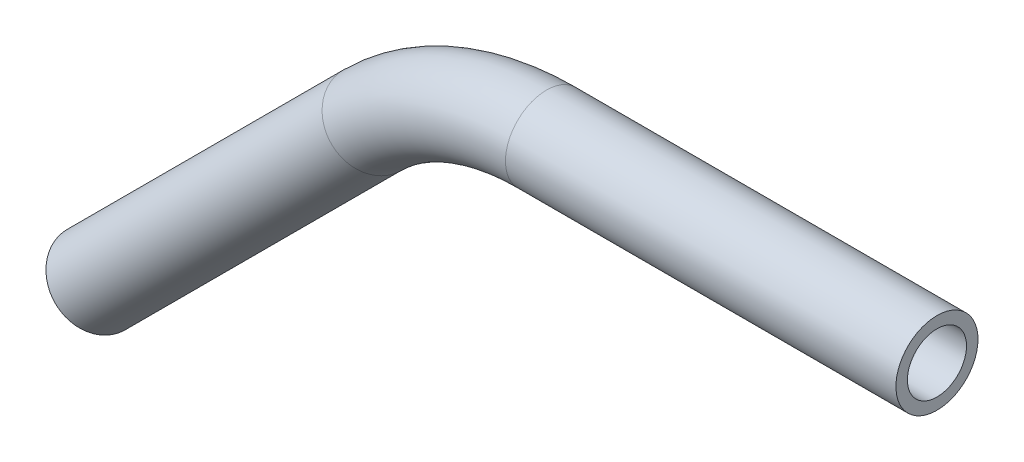
ISO-10303-21;
HEADER;
FILE_DESCRIPTION(('STEP AP214'),'2;1');
FILE_NAME('part.step','',(''),(''),'','','');
FILE_SCHEMA(('AUTOMOTIVE_DESIGN { 1 0 10303 214 1 1 1 1 }'));
ENDSEC;
DATA;
#1=APPLICATION_CONTEXT('core data for automotive mechanical design processes');
#2=APPLICATION_PROTOCOL_DEFINITION('international standard','automotive_design',2000,#1);
#3=PRODUCT_CONTEXT('',#1,'mechanical');
#4=PRODUCT('Part','Part','',(#3));
#5=PRODUCT_RELATED_PRODUCT_CATEGORY('part','',(#4));
#6=PRODUCT_DEFINITION_FORMATION('','',#4);
#7=PRODUCT_DEFINITION_CONTEXT('part definition',#1,'design');
#8=PRODUCT_DEFINITION('design','',#6,#7);
#9=PRODUCT_DEFINITION_SHAPE('','',#8);
#10=(LENGTH_UNIT() NAMED_UNIT(*) SI_UNIT(.MILLI.,.METRE.));
#11=(NAMED_UNIT(*) PLANE_ANGLE_UNIT() SI_UNIT($,.RADIAN.));
#12=(NAMED_UNIT(*) SI_UNIT($,.STERADIAN.) SOLID_ANGLE_UNIT());
#13=UNCERTAINTY_MEASURE_WITH_UNIT(LENGTH_MEASURE(1.E-05),#10,'distance_accuracy_value','');
#14=(GEOMETRIC_REPRESENTATION_CONTEXT(3) GLOBAL_UNCERTAINTY_ASSIGNED_CONTEXT((#13)) GLOBAL_UNIT_ASSIGNED_CONTEXT((#10,
#11,#12)) REPRESENTATION_CONTEXT('',''));
#15=CARTESIAN_POINT('',(0.,0.,0.));
#16=DIRECTION('',(0.,0.,1.));
#17=DIRECTION('',(1.,0.,0.));
#18=AXIS2_PLACEMENT_3D('',#15,#16,#17);
#19=CARTESIAN_POINT('',(-22.4375938414419,-22.437593841442,0.));
#20=DIRECTION('',(0.707106781186547,0.707106781186549,0.));
#21=DIRECTION('',(-0.707106781186549,0.707106781186547,0.));
#22=AXIS2_PLACEMENT_3D('',#19,#20,#21);
#23=CYLINDRICAL_SURFACE('',#22,3.175);
#24=CARTESIAN_POINT('',(-1.07644129663079,-1.0764412966308,0.));
#25=DIRECTION('',(0.707106781186547,0.707106781186549,0.));
#26=DIRECTION('',(0.,0.,-1.));
#27=AXIS2_PLACEMENT_3D('',#24,#25,#26);
#28=CIRCLE('',#27,3.175);
#29=CARTESIAN_POINT('',(-3.32150532689809,1.16862273363648,0.));
#30=VERTEX_POINT('',#29);
#31=EDGE_CURVE('E79',#30,#30,#28,.T.);
#32=ORIENTED_EDGE('',*,*,#31,.F.);
#33=EDGE_LOOP('',(#32));
#34=FACE_BOUND('',#33,.T.);
#35=CARTESIAN_POINT('',(-22.4375938414419,-22.437593841442,0.));
#36=DIRECTION('',(0.707106781186547,0.707106781186549,0.));
#37=DIRECTION('',(0.,0.,-1.));
#38=AXIS2_PLACEMENT_3D('',#35,#36,#37);
#39=CIRCLE('',#38,3.175);
#40=CARTESIAN_POINT('',(-22.4375938414419,-22.437593841442,-3.175));
#41=VERTEX_POINT('',#40);
#42=EDGE_CURVE('E48',#41,#41,#39,.T.);
#43=ORIENTED_EDGE('',*,*,#42,.T.);
#44=EDGE_LOOP('',(#43));
#45=FACE_BOUND('',#44,.T.);
#46=ADVANCED_FACE('F33',(#34,#45),#23,.T.);
#47=CARTESIAN_POINT('',(12.393942884973,-14.5468254782345,0.));
#48=DIRECTION('',(0.,0.,-1.));
#49=DIRECTION('',(-1.,0.,0.));
#50=AXIS2_PLACEMENT_3D('',#47,#48,#49);
#51=TOROIDAL_SURFACE('',#50,19.05,3.175);
#52=CARTESIAN_POINT('',(12.393942884973,4.50317452176552,0.));
#53=DIRECTION('',(1.,0.,0.));
#54=DIRECTION('',(0.,0.,-1.));
#55=AXIS2_PLACEMENT_3D('',#52,#53,#54);
#56=CIRCLE('',#55,3.175);
#57=CARTESIAN_POINT('',(12.393942884973,7.6781745217655,0.));
#58=VERTEX_POINT('',#57);
#59=EDGE_CURVE('E37',#58,#58,#56,.T.);
#60=CARTESIAN_POINT('',(12.393942884973,-14.5468254782345,0.));
#61=DIRECTION('',(0.,0.,-1.));
#62=DIRECTION('',(-1.,0.,0.));
#63=AXIS2_PLACEMENT_3D('',#60,#61,#62);
#64=CIRCLE('',#63,22.225);
#65=EDGE_CURVE('',#30,#58,#64,.T.);
#66=ORIENTED_EDGE('',*,*,#31,.T.);
#67=ORIENTED_EDGE('',*,*,#59,.F.);
#68=ORIENTED_EDGE('',*,*,#65,.T.);
#69=ORIENTED_EDGE('',*,*,#65,.F.);
#70=EDGE_LOOP('',(#66,#68,#67,#69));
#71=FACE_BOUND('',#70,.T.);
#72=ADVANCED_FACE('F87',(#71),#51,.T.);
#73=CARTESIAN_POINT('',(12.393942884973,4.50317452176551,0.));
#74=DIRECTION('',(1.,0.,0.));
#75=DIRECTION('',(0.,1.,0.));
#76=AXIS2_PLACEMENT_3D('',#73,#74,#75);
#77=CYLINDRICAL_SURFACE('',#76,3.175);
#78=CARTESIAN_POINT('',(42.6031745217655,4.50317452176551,0.));
#79=DIRECTION('',(1.,0.,0.));
#80=DIRECTION('',(0.,0.,-1.));
#81=AXIS2_PLACEMENT_3D('',#78,#79,#80);
#82=CIRCLE('',#81,3.175);
#83=CARTESIAN_POINT('',(42.6031745217655,4.50317452176551,-3.175));
#84=VERTEX_POINT('',#83);
#85=EDGE_CURVE('E53',#84,#84,#82,.T.);
#86=ORIENTED_EDGE('',*,*,#85,.F.);
#87=EDGE_LOOP('',(#86));
#88=FACE_BOUND('',#87,.T.);
#89=ORIENTED_EDGE('',*,*,#59,.T.);
#90=EDGE_LOOP('',(#89));
#91=FACE_BOUND('',#90,.T.);
#92=ADVANCED_FACE('F35',(#88,#91),#77,.T.);
#93=CARTESIAN_POINT('',(-22.4375938414419,-22.437593841442,0.));
#94=DIRECTION('',(0.707106781186547,0.707106781186549,0.));
#95=DIRECTION('',(0.,0.,-1.));
#96=AXIS2_PLACEMENT_3D('',#93,#94,#95);
#97=PLANE('',#96);
#98=CARTESIAN_POINT('',(-22.4375938414419,-22.437593841442,0.));
#99=DIRECTION('',(0.707106781186547,0.707106781186549,0.));
#100=DIRECTION('',(0.,0.,-1.));
#101=AXIS2_PLACEMENT_3D('',#98,#99,#100);
#102=CIRCLE('',#101,2.286);
#103=CARTESIAN_POINT('',(-22.4375938414419,-22.437593841442,-2.286));
#104=VERTEX_POINT('',#103);
#105=EDGE_CURVE('E74',#104,#104,#102,.F.);
#106=ORIENTED_EDGE('',*,*,#105,.F.);
#107=EDGE_LOOP('',(#106));
#108=FACE_BOUND('',#107,.T.);
#109=ORIENTED_EDGE('',*,*,#42,.F.);
#110=EDGE_LOOP('',(#109));
#111=FACE_BOUND('',#110,.T.);
#112=ADVANCED_FACE('F93',(#108,#111),#97,.F.);
#113=CARTESIAN_POINT('',(42.6031745217655,4.50317452176551,0.));
#114=DIRECTION('',(1.,0.,0.));
#115=DIRECTION('',(0.,0.,-1.));
#116=AXIS2_PLACEMENT_3D('',#113,#114,#115);
#117=PLANE('',#116);
#118=CARTESIAN_POINT('',(42.6031745217655,4.50317452176551,0.));
#119=DIRECTION('',(1.,0.,0.));
#120=DIRECTION('',(0.,0.,-1.));
#121=AXIS2_PLACEMENT_3D('',#118,#119,#120);
#122=CIRCLE('',#121,2.286);
#123=CARTESIAN_POINT('',(42.6031745217655,4.50317452176551,-2.286));
#124=VERTEX_POINT('',#123);
#125=EDGE_CURVE('E11',#124,#124,#122,.F.);
#126=ORIENTED_EDGE('',*,*,#125,.T.);
#127=EDGE_LOOP('',(#126));
#128=FACE_BOUND('',#127,.T.);
#129=ORIENTED_EDGE('',*,*,#85,.T.);
#130=EDGE_LOOP('',(#129));
#131=FACE_BOUND('',#130,.T.);
#132=ADVANCED_FACE('F60',(#128,#131),#117,.T.);
#133=CARTESIAN_POINT('',(-22.4375938414419,-22.437593841442,0.));
#134=DIRECTION('',(0.707106781186547,0.707106781186549,0.));
#135=DIRECTION('',(-0.707106781186549,0.707106781186547,0.));
#136=AXIS2_PLACEMENT_3D('',#133,#134,#135);
#137=CYLINDRICAL_SURFACE('',#136,2.286);
#138=CARTESIAN_POINT('',(-1.07644129663079,-1.0764412966308,0.));
#139=DIRECTION('',(0.707106781186547,0.707106781186549,0.));
#140=DIRECTION('',(0.,0.,-1.));
#141=AXIS2_PLACEMENT_3D('',#138,#139,#140);
#142=CIRCLE('',#141,2.286);
#143=CARTESIAN_POINT('',(-2.69288739842325,0.540004805161646,0.));
#144=VERTEX_POINT('',#143);
#145=EDGE_CURVE('E71',#144,#144,#142,.F.);
#146=ORIENTED_EDGE('',*,*,#145,.F.);
#147=EDGE_LOOP('',(#146));
#148=FACE_BOUND('',#147,.T.);
#149=ORIENTED_EDGE('',*,*,#105,.T.);
#150=EDGE_LOOP('',(#149));
#151=FACE_BOUND('',#150,.T.);
#152=ADVANCED_FACE('F101',(#148,#151),#137,.F.);
#153=CARTESIAN_POINT('',(12.393942884973,-14.5468254782345,0.));
#154=DIRECTION('',(0.,0.,-1.));
#155=DIRECTION('',(-1.,0.,0.));
#156=AXIS2_PLACEMENT_3D('',#153,#154,#155);
#157=TOROIDAL_SURFACE('',#156,19.05,2.286);
#158=CARTESIAN_POINT('',(12.393942884973,4.50317452176552,0.));
#159=DIRECTION('',(1.,0.,0.));
#160=DIRECTION('',(0.,0.,-1.));
#161=AXIS2_PLACEMENT_3D('',#158,#159,#160);
#162=CIRCLE('',#161,2.286);
#163=CARTESIAN_POINT('',(12.393942884973,6.7891745217655,0.));
#164=VERTEX_POINT('',#163);
#165=EDGE_CURVE('E42',#164,#164,#162,.F.);
#166=CARTESIAN_POINT('',(12.393942884973,-14.5468254782345,0.));
#167=DIRECTION('',(0.,0.,-1.));
#168=DIRECTION('',(-1.,0.,0.));
#169=AXIS2_PLACEMENT_3D('',#166,#167,#168);
#170=CIRCLE('',#169,21.336);
#171=EDGE_CURVE('',#144,#164,#170,.T.);
#172=ORIENTED_EDGE('',*,*,#145,.T.);
#173=ORIENTED_EDGE('',*,*,#165,.F.);
#174=ORIENTED_EDGE('',*,*,#171,.T.);
#175=ORIENTED_EDGE('',*,*,#171,.F.);
#176=EDGE_LOOP('',(#172,#174,#173,#175));
#177=FACE_BOUND('',#176,.T.);
#178=ADVANCED_FACE('F66',(#177),#157,.F.);
#179=CARTESIAN_POINT('',(12.393942884973,4.50317452176551,0.));
#180=DIRECTION('',(1.,0.,0.));
#181=DIRECTION('',(0.,1.,0.));
#182=AXIS2_PLACEMENT_3D('',#179,#180,#181);
#183=CYLINDRICAL_SURFACE('',#182,2.286);
#184=ORIENTED_EDGE('',*,*,#125,.F.);
#185=EDGE_LOOP('',(#184));
#186=FACE_BOUND('',#185,.T.);
#187=ORIENTED_EDGE('',*,*,#165,.T.);
#188=EDGE_LOOP('',(#187));
#189=FACE_BOUND('',#188,.T.);
#190=ADVANCED_FACE('F63',(#186,#189),#183,.F.);
#191=CLOSED_SHELL('',(#46,#72,#92,#112,#132,#152,#178,#190));
#192=MANIFOLD_SOLID_BREP('B2',#191);
#193=ADVANCED_BREP_SHAPE_REPRESENTATION('',(#18,#192),#14);
#194=SHAPE_DEFINITION_REPRESENTATION(#9,#193);
ENDSEC;
END-ISO-10303-21;
